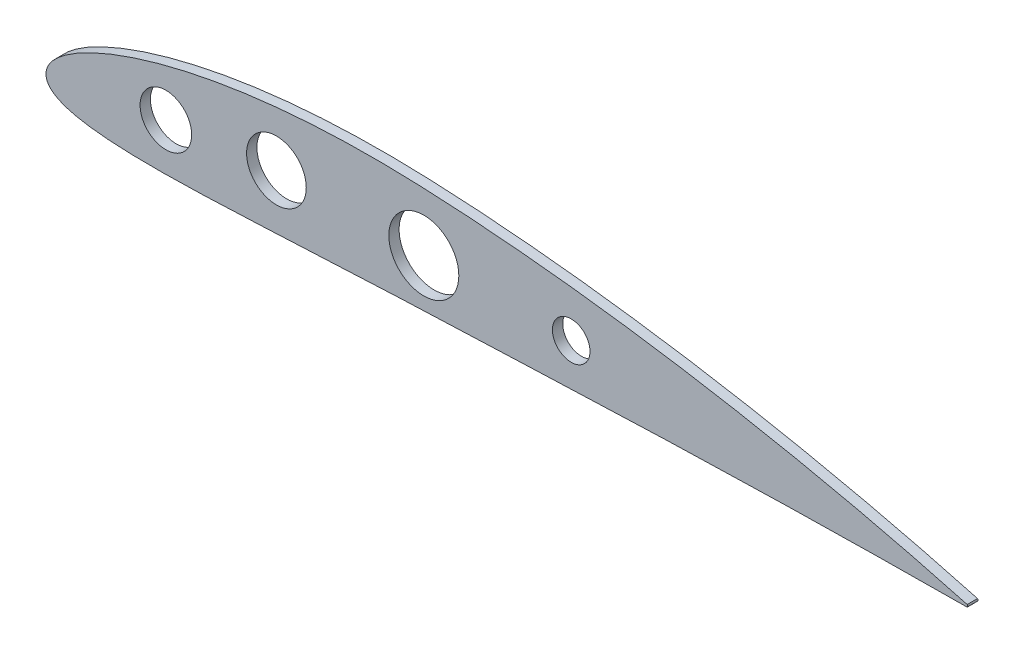
ISO-10303-21;
HEADER;
FILE_DESCRIPTION(('STEP AP214'),'2;1');
FILE_NAME('part.step','',(''),(''),'','','');
FILE_SCHEMA(('AUTOMOTIVE_DESIGN { 1 0 10303 214 1 1 1 1 }'));
ENDSEC;
DATA;
#1=APPLICATION_CONTEXT('core data for automotive mechanical design processes');
#2=APPLICATION_PROTOCOL_DEFINITION('international standard','automotive_design',2000,#1);
#3=PRODUCT_CONTEXT('',#1,'mechanical');
#4=PRODUCT('Part','Part','',(#3));
#5=PRODUCT_RELATED_PRODUCT_CATEGORY('part','',(#4));
#6=PRODUCT_DEFINITION_FORMATION('','',#4);
#7=PRODUCT_DEFINITION_CONTEXT('part definition',#1,'design');
#8=PRODUCT_DEFINITION('design','',#6,#7);
#9=PRODUCT_DEFINITION_SHAPE('','',#8);
#10=(LENGTH_UNIT() NAMED_UNIT(*) SI_UNIT(.MILLI.,.METRE.));
#11=(NAMED_UNIT(*) PLANE_ANGLE_UNIT() SI_UNIT($,.RADIAN.));
#12=(NAMED_UNIT(*) SI_UNIT($,.STERADIAN.) SOLID_ANGLE_UNIT());
#13=UNCERTAINTY_MEASURE_WITH_UNIT(LENGTH_MEASURE(1.E-05),#10,'distance_accuracy_value','');
#14=(GEOMETRIC_REPRESENTATION_CONTEXT(3) GLOBAL_UNCERTAINTY_ASSIGNED_CONTEXT((#13)) GLOBAL_UNIT_ASSIGNED_CONTEXT((#10,
#11,#12)) REPRESENTATION_CONTEXT('',''));
#15=CARTESIAN_POINT('',(0.,0.,0.));
#16=DIRECTION('',(0.,0.,1.));
#17=DIRECTION('',(1.,0.,0.));
#18=AXIS2_PLACEMENT_3D('',#15,#16,#17);
#19=CARTESIAN_POINT('',(123.038526752948,23.1212162426246,1.4));
#20=DIRECTION('',(0.,0.,-1.));
#21=DIRECTION('',(-1.,0.,0.));
#22=AXIS2_PLACEMENT_3D('',#19,#20,#21);
#23=PLANE('',#22);
#24=CARTESIAN_POINT('',(250.,0.315,1.4));
#25=CARTESIAN_POINT('',(249.1556677398,0.545019817836279,1.4));
#26=CARTESIAN_POINT('',(246.72017569763,1.20851624251313,1.4));
#27=CARTESIAN_POINT('',(242.39133208333,2.35833905261626,1.4));
#28=CARTESIAN_POINT('',(236.8497612043,3.78762536446423,1.4));
#29=CARTESIAN_POINT('',(230.779918279366,5.29800883725429,1.4));
#30=CARTESIAN_POINT('',(224.455917947462,6.81286602762795,1.4));
#31=CARTESIAN_POINT('',(218.030543495663,8.2916106324586,1.4));
#32=CARTESIAN_POINT('',(211.562405044606,9.71973505661334,1.4));
#33=CARTESIAN_POINT('',(205.072411508973,11.0923749324442,1.4));
#34=CARTESIAN_POINT('',(198.567970912658,12.4078507263971,1.4));
#35=CARTESIAN_POINT('',(192.05236991352,13.6652979238497,1.4));
#36=CARTESIAN_POINT('',(185.527619972818,14.8640933031022,1.4));
#37=CARTESIAN_POINT('',(178.995338991115,16.0034047787228,1.4));
#38=CARTESIAN_POINT('',(172.457064741278,17.0823881152075,1.4));
#39=CARTESIAN_POINT('',(165.914317094847,18.0998278411168,1.4));
#40=CARTESIAN_POINT('',(159.368680729007,19.0545018148018,1.4));
#41=CARTESIAN_POINT('',(152.821805127969,19.9448856028229,1.4));
#42=CARTESIAN_POINT('',(146.275439401362,20.76928218283,1.4));
#43=CARTESIAN_POINT('',(139.731359791294,21.5256761133202,1.4));
#44=CARTESIAN_POINT('',(133.191836730309,22.2120042488889,1.4));
#45=CARTESIAN_POINT('',(126.658683026114,22.8257214286805,1.4));
#46=CARTESIAN_POINT('',(120.136770918309,23.363973266088,1.4));
#47=CARTESIAN_POINT('',(113.628567140501,23.8246773240715,1.4));
#48=CARTESIAN_POINT('',(107.152732037453,24.2002425936989,1.4));
#49=CARTESIAN_POINT('',(100.741095692949,24.4983995100481,1.4));
#50=CARTESIAN_POINT('',(94.4117527148801,24.6866497684384,1.4));
#51=CARTESIAN_POINT('',(88.1559179929208,24.7400956502598,1.4));
#52=CARTESIAN_POINT('',(81.9490430552625,24.658849143563,1.4));
#53=CARTESIAN_POINT('',(75.7805205915729,24.4410138083138,1.4));
#54=CARTESIAN_POINT('',(69.653692942001,24.0818848206021,1.4));
#55=CARTESIAN_POINT('',(63.5754105017725,23.5780063609574,1.4));
#56=CARTESIAN_POINT('',(57.5551895509689,22.9249466580897,1.4));
#57=CARTESIAN_POINT('',(51.6057626883655,22.1190655216041,1.4));
#58=CARTESIAN_POINT('',(45.7444003114454,21.1565644320825,1.4));
#59=CARTESIAN_POINT('',(39.9958575941734,20.035371389506,1.4));
#60=CARTESIAN_POINT('',(34.397919842374,18.756316234168,1.4));
#61=CARTESIAN_POINT('',(29.0103821035244,17.327615607561,1.4));
#62=CARTESIAN_POINT('',(23.9257984082512,15.7718649214876,1.4));
#63=CARTESIAN_POINT('',(19.2706788398757,14.1342694339559,1.4));
#64=CARTESIAN_POINT('',(15.1790983912921,12.4833354375465,1.4));
#65=CARTESIAN_POINT('',(11.7404757900967,10.8956109948061,1.4));
#66=CARTESIAN_POINT('',(8.95937186897629,9.42957736532332,1.4));
#67=CARTESIAN_POINT('',(6.76089118010329,8.10860319940964,1.4));
#68=CARTESIAN_POINT('',(5.03370974806799,6.92463805475642,1.4));
#69=CARTESIAN_POINT('',(3.67169493343308,5.85422966432144,1.4));
#70=CARTESIAN_POINT('',(2.59210112319415,4.87130536863603,1.4));
#71=CARTESIAN_POINT('',(1.73817566850273,3.95259574329487,1.4));
#72=CARTESIAN_POINT('',(1.06987082981603,3.08094637334676,1.4));
#73=CARTESIAN_POINT('',(0.571645410381898,2.24162210227498,1.4));
#74=CARTESIAN_POINT('',(0.215773898828885,1.43078539700941,1.4));
#75=CARTESIAN_POINT('',(0.102255581551055,0.88324169451159,1.4));
#76=CARTESIAN_POINT('',(0.047975,0.621425,1.4));
#77=B_SPLINE_CURVE_WITH_KNOTS('',3,(#24,#25,#26,#27,#28,#29,#30,#31,#32,#33,#34,#35,#36,#37,#38,
#39,#40,#41,#42,#43,#44,#45,#46,#47,#48,#49,#50,#51,#52,#53,#54,#55,#56,#57,#58,#59,#60,#61,#62,
#63,#64,#65,#66,#67,#68,#69,#70,#71,#72,#73,#74,#75,#76),.UNSPECIFIED.,.F.,.F.,(4,1,1,1,1,1,1,1,
1,1,1,1,1,1,1,1,1,1,1,1,1,1,1,1,1,1,1,1,1,1,1,1,1,1,1,1,1,1,1,1,1,1,1,1,1,1,1,1,1,1,4),(0.,
0.0101621996718152,0.029313053164405,0.0520116049167946,0.0766194676467142,0.101948061207292,
0.127526131749972,0.153184130655642,0.178867887696566,0.204557902716051,0.230245711588722,
0.255925967287604,0.281594302232909,0.307246419826604,0.332878041533464,0.358484538095463,
0.384061185999046,0.409602822472883,0.435103874040524,0.460559416336008,0.485959195382529,
0.511303069995141,0.53655151535457,0.561723365940153,0.586628866723787,0.611085431247163,
0.63525120042125,0.659272175841394,0.683163753229342,0.706922144180534,0.730535909866309,
0.753983199646257,0.777234690063445,0.800246382303428,0.822950708941546,0.845237155368769,
0.866915895838024,0.887662334604257,0.906968280539555,0.924203157053238,0.938878974509372,
0.95093161065299,0.960693484285195,0.968646729467272,0.975232933115936,0.980794743901537,
0.985583761312909,0.989781538836832,0.99352131251264,0.996902112954681,1.),.UNSPECIFIED.);
#78=CARTESIAN_POINT('',(250.,0.315,1.4));
#79=VERTEX_POINT('',#78);
#80=CARTESIAN_POINT('',(0.047975,0.621425,1.4));
#81=VERTEX_POINT('',#80);
#82=EDGE_CURVE('E83',#79,#81,#77,.T.);
#83=ORIENTED_EDGE('',*,*,#82,.T.);
#84=CARTESIAN_POINT('',(0.047975,0.621425,1.4));
#85=CARTESIAN_POINT('',(0.0227138203276048,0.373490085622791,1.4));
#86=CARTESIAN_POINT('',(-0.0278207890067418,-0.122499975050766,1.4));
#87=CARTESIAN_POINT('',(0.0779912124025658,-0.884434590165201,1.4));
#88=CARTESIAN_POINT('',(0.349695650479558,-1.63883807038276,1.4));
#89=CARTESIAN_POINT('',(0.814331135146287,-2.36506892355371,1.4));
#90=CARTESIAN_POINT('',(1.46348078042047,-3.03927524464629,1.4));
#91=CARTESIAN_POINT('',(2.29097301668935,-3.66099946963366,1.4));
#92=CARTESIAN_POINT('',(3.30592875031006,-4.23577962104374,1.4));
#93=CARTESIAN_POINT('',(4.53525561919462,-4.77367414359886,1.4));
#94=CARTESIAN_POINT('',(6.02974568831117,-5.28219216459101,1.4));
#95=CARTESIAN_POINT('',(7.86898121528962,-5.76531667645348,1.4));
#96=CARTESIAN_POINT('',(10.1688313918654,-6.22171659288376,1.4));
#97=CARTESIAN_POINT('',(13.0754381888996,-6.63961873115542,1.4));
#98=CARTESIAN_POINT('',(16.7281153626706,-6.9929567376365,1.4));
#99=CARTESIAN_POINT('',(21.1899520960701,-7.24734514465608,1.4));
#100=CARTESIAN_POINT('',(26.3999844156156,-7.37663884892169,1.4));
#101=CARTESIAN_POINT('',(32.1973985639414,-7.3762569130408,1.4));
#102=CARTESIAN_POINT('',(38.3978067590662,-7.26143657976799,1.4));
#103=CARTESIAN_POINT('',(44.8576217679783,-7.05664135813184,1.4));
#104=CARTESIAN_POINT('',(51.4865430961494,-6.78645353187047,1.4));
#105=CARTESIAN_POINT('',(58.2309809321351,-6.47232458681409,1.4));
#106=CARTESIAN_POINT('',(65.0520946060131,-6.13285226454697,1.4));
#107=CARTESIAN_POINT('',(71.9107727092338,-5.78400517676069,1.4));
#108=CARTESIAN_POINT('',(78.7713755761997,-5.43968045365919,1.4));
#109=CARTESIAN_POINT('',(85.6104986098046,-5.1109512525955,1.4));
#110=CARTESIAN_POINT('',(92.4321075899298,-4.80495332575523,1.4));
#111=CARTESIAN_POINT('',(99.2550311901141,-4.53198165486052,1.4));
#112=CARTESIAN_POINT('',(106.097378404906,-4.2782746709768,1.4));
#113=CARTESIAN_POINT('',(112.96921168025,-4.00308992595863,1.4));
#114=CARTESIAN_POINT('',(119.864404254545,-3.72317618427209,1.4));
#115=CARTESIAN_POINT('',(126.773860473488,-3.44006729642004,1.4));
#116=CARTESIAN_POINT('',(133.681563213165,-3.15869560044929,1.4));
#117=CARTESIAN_POINT('',(140.581870407101,-2.88238072043892,1.4));
#118=CARTESIAN_POINT('',(147.472013761627,-2.6139229582865,1.4));
#119=CARTESIAN_POINT('',(154.352602410646,-2.35562641484789,1.4));
#120=CARTESIAN_POINT('',(161.225044134142,-2.10936992107383,1.4));
#121=CARTESIAN_POINT('',(168.090869746121,-1.87663407429386,1.4));
#122=CARTESIAN_POINT('',(174.951578521953,-1.65864310401416,1.4));
#123=CARTESIAN_POINT('',(181.808595965615,-1.45637812303537,1.4));
#124=CARTESIAN_POINT('',(188.663234462377,-1.27038337720763,1.4));
#125=CARTESIAN_POINT('',(195.516645167653,-1.10111288413947,1.4));
#126=CARTESIAN_POINT('',(202.369532893738,-0.948617188746303,1.4));
#127=CARTESIAN_POINT('',(211.499190290366,-0.767742353448254,1.4));
#128=CARTESIAN_POINT('',(220.6030986659,-0.619939742232208,1.4));
#129=CARTESIAN_POINT('',(229.617630172189,-0.502926179992112,1.4));
#130=CARTESIAN_POINT('',(236.087353853958,-0.431514191705789,1.4));
#131=CARTESIAN_POINT('',(241.980776912644,-0.376520461448702,1.4));
#132=CARTESIAN_POINT('',(246.558970010782,-0.339535885915444,1.4));
#133=CARTESIAN_POINT('',(249.120490964528,-0.321271242454606,1.4));
#134=CARTESIAN_POINT('',(250.,-0.315,1.4));
#135=B_SPLINE_CURVE_WITH_KNOTS('',3,(#84,#85,#86,#87,#88,#89,#90,#91,#92,#93,#94,#95,#96,#97,
#98,#99,#100,#101,#102,#103,#104,#105,#106,#107,#108,#109,#110,#111,#112,#113,#114,#115,#116,
#117,#118,#119,#120,#121,#122,#123,#124,#125,#126,#127,#128,#129,#130,#131,#132,#133,#134),
.UNSPECIFIED.,.F.,.F.,(4,1,1,1,1,1,1,1,1,1,1,1,1,1,1,1,1,1,1,1,1,1,1,1,1,1,1,1,1,1,1,1,1,1,1,1,
1,1,1,1,1,1,1,1,1,1,1,1,4),(0.,0.00294144629716841,0.00588431899986843,0.00901612990907169,
0.0123645467308032,0.0160079338878462,0.0200368451305784,0.0245737277973679,0.029783834741521,
0.0358970100073663,0.043240439578336,0.0522759653413005,0.0636345893302709,0.0779831757705632,
0.0956981612833506,0.116520086015495,0.139660730330278,0.164312170171254,0.189918890388145,
0.216157201054431,0.242837761985605,0.269833582781319,0.296993021546457,0.324123271890544,
0.351139106824528,0.378035508721976,0.404946015910257,0.431960836658272,0.459078394602815,
0.486347400324305,0.513640830241323,0.540928594677757,0.568176028038828,0.595379568955062,
0.622543444942076,0.6496732603013,0.676775201241309,0.70385522836994,0.730918774891245,
0.757971338224895,0.785017763038357,0.812061650836912,0.839103366014866,0.893099151655267,
0.919831064622048,0.945809917390178,0.96968060086528,0.989589706283647,1.),.UNSPECIFIED.);
#136=CARTESIAN_POINT('',(250.,-0.315,1.4));
#137=VERTEX_POINT('',#136);
#138=EDGE_CURVE('E78',#81,#137,#135,.T.);
#139=ORIENTED_EDGE('',*,*,#138,.T.);
#140=CARTESIAN_POINT('',(249.685,0.,1.4));
#141=DIRECTION('',(0.,0.,1.));
#142=DIRECTION('',(-1.,0.,0.));
#143=AXIS2_PLACEMENT_3D('',#140,#141,#142);
#144=CIRCLE('',#143,0.445477272147512);
#145=EDGE_CURVE('E58',#137,#79,#144,.T.);
#146=ORIENTED_EDGE('',*,*,#145,.T.);
#147=EDGE_LOOP('',(#83,#139,#146));
#148=FACE_BOUND('',#147,.T.);
#149=CARTESIAN_POINT('',(62.5326193180369,8.59619720770189,1.4));
#150=DIRECTION('',(0.,0.,1.));
#151=DIRECTION('',(1.,0.,0.));
#152=AXIS2_PLACEMENT_3D('',#149,#150,#151);
#153=CIRCLE('',#152,8.09999999999999);
#154=CARTESIAN_POINT('',(70.6326193180369,8.59619720770189,1.4));
#155=VERTEX_POINT('',#154);
#156=EDGE_CURVE('E94',#155,#155,#153,.T.);
#157=ORIENTED_EDGE('',*,*,#156,.F.);
#158=EDGE_LOOP('',(#157));
#159=FACE_BOUND('',#158,.T.);
#160=CARTESIAN_POINT('',(142.532619318037,8.5961972076993,1.4));
#161=DIRECTION('',(0.,0.,1.));
#162=DIRECTION('',(1.,0.,0.));
#163=AXIS2_PLACEMENT_3D('',#160,#161,#162);
#164=CIRCLE('',#163,5.09999999999998);
#165=CARTESIAN_POINT('',(147.632619318037,8.5961972076993,1.4));
#166=VERTEX_POINT('',#165);
#167=EDGE_CURVE('E147',#166,#166,#164,.T.);
#168=ORIENTED_EDGE('',*,*,#167,.F.);
#169=EDGE_LOOP('',(#168));
#170=FACE_BOUND('',#169,.T.);
#171=CARTESIAN_POINT('',(102.532619318037,8.5961972076993,1.4));
#172=DIRECTION('',(0.,0.,1.));
#173=DIRECTION('',(1.,0.,0.));
#174=AXIS2_PLACEMENT_3D('',#171,#172,#173);
#175=CIRCLE('',#174,9.5);
#176=CARTESIAN_POINT('',(112.032619318037,8.5961972076993,1.4));
#177=VERTEX_POINT('',#176);
#178=EDGE_CURVE('E140',#177,#177,#175,.T.);
#179=ORIENTED_EDGE('',*,*,#178,.F.);
#180=EDGE_LOOP('',(#179));
#181=FACE_BOUND('',#180,.T.);
#182=CARTESIAN_POINT('',(32.5326193180369,5.44814470114742,1.4));
#183=DIRECTION('',(0.,0.,1.));
#184=DIRECTION('',(1.,0.,0.));
#185=AXIS2_PLACEMENT_3D('',#182,#183,#184);
#186=CIRCLE('',#185,7.);
#187=CARTESIAN_POINT('',(39.5326193180369,5.44814470114742,1.4));
#188=VERTEX_POINT('',#187);
#189=EDGE_CURVE('E133',#188,#188,#186,.T.);
#190=ORIENTED_EDGE('',*,*,#189,.F.);
#191=EDGE_LOOP('',(#190));
#192=FACE_BOUND('',#191,.T.);
#193=ADVANCED_FACE('F39',(#148,#159,#170,#181,#192),#23,.F.);
#194=CARTESIAN_POINT('',(123.038526752948,23.1212162426246,-1.4));
#195=DIRECTION('',(0.,0.,-1.));
#196=DIRECTION('',(-1.,0.,0.));
#197=AXIS2_PLACEMENT_3D('',#194,#195,#196);
#198=PLANE('',#197);
#199=CARTESIAN_POINT('',(102.532619318037,8.5961972076993,-1.4));
#200=DIRECTION('',(0.,0.,1.));
#201=DIRECTION('',(1.,0.,0.));
#202=AXIS2_PLACEMENT_3D('',#199,#200,#201);
#203=CIRCLE('',#202,9.5);
#204=CARTESIAN_POINT('',(112.032619318037,8.5961972076993,-1.4));
#205=VERTEX_POINT('',#204);
#206=EDGE_CURVE('E137',#205,#205,#203,.T.);
#207=ORIENTED_EDGE('',*,*,#206,.T.);
#208=EDGE_LOOP('',(#207));
#209=FACE_BOUND('',#208,.T.);
#210=CARTESIAN_POINT('',(62.5326193180369,8.59619720770189,-1.4));
#211=DIRECTION('',(0.,0.,1.));
#212=DIRECTION('',(1.,0.,0.));
#213=AXIS2_PLACEMENT_3D('',#210,#211,#212);
#214=CIRCLE('',#213,8.09999999999999);
#215=CARTESIAN_POINT('',(70.6326193180369,8.59619720770189,-1.4));
#216=VERTEX_POINT('',#215);
#217=EDGE_CURVE('E100',#216,#216,#214,.T.);
#218=ORIENTED_EDGE('',*,*,#217,.T.);
#219=EDGE_LOOP('',(#218));
#220=FACE_BOUND('',#219,.T.);
#221=CARTESIAN_POINT('',(250.,0.315,-1.4));
#222=CARTESIAN_POINT('',(249.1556677398,0.545019817836279,-1.4));
#223=CARTESIAN_POINT('',(246.72017569763,1.20851624251313,-1.4));
#224=CARTESIAN_POINT('',(242.39133208333,2.35833905261626,-1.4));
#225=CARTESIAN_POINT('',(236.8497612043,3.78762536446423,-1.4));
#226=CARTESIAN_POINT('',(230.779918279366,5.29800883725429,-1.4));
#227=CARTESIAN_POINT('',(224.455917947462,6.81286602762795,-1.4));
#228=CARTESIAN_POINT('',(218.030543495663,8.2916106324586,-1.4));
#229=CARTESIAN_POINT('',(211.562405044606,9.71973505661334,-1.4));
#230=CARTESIAN_POINT('',(205.072411508973,11.0923749324442,-1.4));
#231=CARTESIAN_POINT('',(198.567970912658,12.4078507263971,-1.4));
#232=CARTESIAN_POINT('',(192.05236991352,13.6652979238497,-1.4));
#233=CARTESIAN_POINT('',(185.527619972818,14.8640933031022,-1.4));
#234=CARTESIAN_POINT('',(178.995338991115,16.0034047787228,-1.4));
#235=CARTESIAN_POINT('',(172.457064741278,17.0823881152075,-1.4));
#236=CARTESIAN_POINT('',(165.914317094847,18.0998278411168,-1.4));
#237=CARTESIAN_POINT('',(159.368680729007,19.0545018148018,-1.4));
#238=CARTESIAN_POINT('',(152.821805127969,19.9448856028229,-1.4));
#239=CARTESIAN_POINT('',(146.275439401362,20.76928218283,-1.4));
#240=CARTESIAN_POINT('',(139.731359791294,21.5256761133202,-1.4));
#241=CARTESIAN_POINT('',(133.191836730309,22.2120042488889,-1.4));
#242=CARTESIAN_POINT('',(126.658683026114,22.8257214286805,-1.4));
#243=CARTESIAN_POINT('',(120.136770918309,23.363973266088,-1.4));
#244=CARTESIAN_POINT('',(113.628567140501,23.8246773240715,-1.4));
#245=CARTESIAN_POINT('',(107.152732037453,24.2002425936989,-1.4));
#246=CARTESIAN_POINT('',(100.741095692949,24.4983995100481,-1.4));
#247=CARTESIAN_POINT('',(94.4117527148801,24.6866497684384,-1.4));
#248=CARTESIAN_POINT('',(88.1559179929208,24.7400956502598,-1.4));
#249=CARTESIAN_POINT('',(81.9490430552625,24.658849143563,-1.4));
#250=CARTESIAN_POINT('',(75.7805205915729,24.4410138083138,-1.4));
#251=CARTESIAN_POINT('',(69.653692942001,24.0818848206021,-1.4));
#252=CARTESIAN_POINT('',(63.5754105017725,23.5780063609574,-1.4));
#253=CARTESIAN_POINT('',(57.5551895509689,22.9249466580897,-1.4));
#254=CARTESIAN_POINT('',(51.6057626883655,22.1190655216041,-1.4));
#255=CARTESIAN_POINT('',(45.7444003114454,21.1565644320825,-1.4));
#256=CARTESIAN_POINT('',(39.9958575941734,20.035371389506,-1.4));
#257=CARTESIAN_POINT('',(34.397919842374,18.756316234168,-1.4));
#258=CARTESIAN_POINT('',(29.0103821035244,17.327615607561,-1.4));
#259=CARTESIAN_POINT('',(23.9257984082512,15.7718649214876,-1.4));
#260=CARTESIAN_POINT('',(19.2706788398757,14.1342694339559,-1.4));
#261=CARTESIAN_POINT('',(15.1790983912921,12.4833354375465,-1.4));
#262=CARTESIAN_POINT('',(11.7404757900967,10.8956109948061,-1.4));
#263=CARTESIAN_POINT('',(8.95937186897629,9.42957736532332,-1.4));
#264=CARTESIAN_POINT('',(6.76089118010329,8.10860319940964,-1.4));
#265=CARTESIAN_POINT('',(5.03370974806799,6.92463805475642,-1.4));
#266=CARTESIAN_POINT('',(3.67169493343308,5.85422966432144,-1.4));
#267=CARTESIAN_POINT('',(2.59210112319415,4.87130536863603,-1.4));
#268=CARTESIAN_POINT('',(1.73817566850273,3.95259574329487,-1.4));
#269=CARTESIAN_POINT('',(1.06987082981603,3.08094637334676,-1.4));
#270=CARTESIAN_POINT('',(0.571645410381898,2.24162210227498,-1.4));
#271=CARTESIAN_POINT('',(0.215773898828885,1.43078539700941,-1.4));
#272=CARTESIAN_POINT('',(0.102255581551055,0.88324169451159,-1.4));
#273=CARTESIAN_POINT('',(0.047975,0.621425,-1.4));
#274=B_SPLINE_CURVE_WITH_KNOTS('',3,(#221,#222,#223,#224,#225,#226,#227,#228,#229,#230,#231,
#232,#233,#234,#235,#236,#237,#238,#239,#240,#241,#242,#243,#244,#245,#246,#247,#248,#249,#250,
#251,#252,#253,#254,#255,#256,#257,#258,#259,#260,#261,#262,#263,#264,#265,#266,#267,#268,#269,
#270,#271,#272,#273),.UNSPECIFIED.,.F.,.F.,(4,1,1,1,1,1,1,1,1,1,1,1,1,1,1,1,1,1,1,1,1,1,1,1,1,1,
1,1,1,1,1,1,1,1,1,1,1,1,1,1,1,1,1,1,1,1,1,1,1,1,4),(0.,0.0101621996718152,0.029313053164405,
0.0520116049167946,0.0766194676467142,0.101948061207292,0.127526131749972,0.153184130655642,
0.178867887696566,0.204557902716051,0.230245711588722,0.255925967287604,0.281594302232909,
0.307246419826604,0.332878041533464,0.358484538095463,0.384061185999046,0.409602822472883,
0.435103874040524,0.460559416336008,0.485959195382529,0.511303069995141,0.53655151535457,
0.561723365940153,0.586628866723787,0.611085431247163,0.63525120042125,0.659272175841394,
0.683163753229342,0.706922144180534,0.730535909866309,0.753983199646257,0.777234690063445,
0.800246382303428,0.822950708941546,0.845237155368769,0.866915895838024,0.887662334604257,
0.906968280539555,0.924203157053238,0.938878974509372,0.95093161065299,0.960693484285195,
0.968646729467272,0.975232933115936,0.980794743901537,0.985583761312909,0.989781538836832,
0.99352131251264,0.996902112954681,1.),.UNSPECIFIED.);
#275=CARTESIAN_POINT('',(250.,0.315,-1.4));
#276=VERTEX_POINT('',#275);
#277=CARTESIAN_POINT('',(0.047975,0.621425,-1.4));
#278=VERTEX_POINT('',#277);
#279=EDGE_CURVE('E90',#276,#278,#274,.T.);
#280=ORIENTED_EDGE('',*,*,#279,.F.);
#281=CARTESIAN_POINT('',(249.685,0.,-1.4));
#282=DIRECTION('',(0.,0.,1.));
#283=DIRECTION('',(-1.,0.,0.));
#284=AXIS2_PLACEMENT_3D('',#281,#282,#283);
#285=CIRCLE('',#284,0.445477272147512);
#286=CARTESIAN_POINT('',(250.,-0.315,-1.4));
#287=VERTEX_POINT('',#286);
#288=EDGE_CURVE('E75',#287,#276,#285,.T.);
#289=ORIENTED_EDGE('',*,*,#288,.F.);
#290=CARTESIAN_POINT('',(0.047975,0.621425,-1.4));
#291=CARTESIAN_POINT('',(0.0227138203276048,0.373490085622791,-1.4));
#292=CARTESIAN_POINT('',(-0.0278207890067418,-0.122499975050766,-1.4));
#293=CARTESIAN_POINT('',(0.0779912124025658,-0.884434590165201,-1.4));
#294=CARTESIAN_POINT('',(0.349695650479558,-1.63883807038276,-1.4));
#295=CARTESIAN_POINT('',(0.814331135146287,-2.36506892355371,-1.4));
#296=CARTESIAN_POINT('',(1.46348078042047,-3.03927524464629,-1.4));
#297=CARTESIAN_POINT('',(2.29097301668935,-3.66099946963366,-1.4));
#298=CARTESIAN_POINT('',(3.30592875031006,-4.23577962104374,-1.4));
#299=CARTESIAN_POINT('',(4.53525561919462,-4.77367414359886,-1.4));
#300=CARTESIAN_POINT('',(6.02974568831117,-5.28219216459101,-1.4));
#301=CARTESIAN_POINT('',(7.86898121528962,-5.76531667645348,-1.4));
#302=CARTESIAN_POINT('',(10.1688313918654,-6.22171659288376,-1.4));
#303=CARTESIAN_POINT('',(13.0754381888996,-6.63961873115542,-1.4));
#304=CARTESIAN_POINT('',(16.7281153626706,-6.9929567376365,-1.4));
#305=CARTESIAN_POINT('',(21.1899520960701,-7.24734514465608,-1.4));
#306=CARTESIAN_POINT('',(26.3999844156156,-7.37663884892169,-1.4));
#307=CARTESIAN_POINT('',(32.1973985639414,-7.3762569130408,-1.4));
#308=CARTESIAN_POINT('',(38.3978067590662,-7.26143657976799,-1.4));
#309=CARTESIAN_POINT('',(44.8576217679783,-7.05664135813184,-1.4));
#310=CARTESIAN_POINT('',(51.4865430961494,-6.78645353187047,-1.4));
#311=CARTESIAN_POINT('',(58.2309809321351,-6.47232458681409,-1.4));
#312=CARTESIAN_POINT('',(65.0520946060131,-6.13285226454697,-1.4));
#313=CARTESIAN_POINT('',(71.9107727092338,-5.78400517676069,-1.4));
#314=CARTESIAN_POINT('',(78.7713755761997,-5.43968045365919,-1.4));
#315=CARTESIAN_POINT('',(85.6104986098046,-5.1109512525955,-1.4));
#316=CARTESIAN_POINT('',(92.4321075899298,-4.80495332575523,-1.4));
#317=CARTESIAN_POINT('',(99.2550311901141,-4.53198165486052,-1.4));
#318=CARTESIAN_POINT('',(106.097378404906,-4.2782746709768,-1.4));
#319=CARTESIAN_POINT('',(112.96921168025,-4.00308992595863,-1.4));
#320=CARTESIAN_POINT('',(119.864404254545,-3.72317618427209,-1.4));
#321=CARTESIAN_POINT('',(126.773860473488,-3.44006729642004,-1.4));
#322=CARTESIAN_POINT('',(133.681563213165,-3.15869560044929,-1.4));
#323=CARTESIAN_POINT('',(140.581870407101,-2.88238072043892,-1.4));
#324=CARTESIAN_POINT('',(147.472013761627,-2.6139229582865,-1.4));
#325=CARTESIAN_POINT('',(154.352602410646,-2.35562641484789,-1.4));
#326=CARTESIAN_POINT('',(161.225044134142,-2.10936992107383,-1.4));
#327=CARTESIAN_POINT('',(168.090869746121,-1.87663407429386,-1.4));
#328=CARTESIAN_POINT('',(174.951578521953,-1.65864310401416,-1.4));
#329=CARTESIAN_POINT('',(181.808595965615,-1.45637812303537,-1.4));
#330=CARTESIAN_POINT('',(188.663234462377,-1.27038337720763,-1.4));
#331=CARTESIAN_POINT('',(195.516645167653,-1.10111288413947,-1.4));
#332=CARTESIAN_POINT('',(202.369532893738,-0.948617188746303,-1.4));
#333=CARTESIAN_POINT('',(211.499190290366,-0.767742353448254,-1.4));
#334=CARTESIAN_POINT('',(220.6030986659,-0.619939742232208,-1.4));
#335=CARTESIAN_POINT('',(229.617630172189,-0.502926179992112,-1.4));
#336=CARTESIAN_POINT('',(236.087353853958,-0.431514191705789,-1.4));
#337=CARTESIAN_POINT('',(241.980776912644,-0.376520461448702,-1.4));
#338=CARTESIAN_POINT('',(246.558970010782,-0.339535885915444,-1.4));
#339=CARTESIAN_POINT('',(249.120490964528,-0.321271242454606,-1.4));
#340=CARTESIAN_POINT('',(250.,-0.315,-1.4));
#341=B_SPLINE_CURVE_WITH_KNOTS('',3,(#290,#291,#292,#293,#294,#295,#296,#297,#298,#299,#300,
#301,#302,#303,#304,#305,#306,#307,#308,#309,#310,#311,#312,#313,#314,#315,#316,#317,#318,#319,
#320,#321,#322,#323,#324,#325,#326,#327,#328,#329,#330,#331,#332,#333,#334,#335,#336,#337,#338,
#339,#340),.UNSPECIFIED.,.F.,.F.,(4,1,1,1,1,1,1,1,1,1,1,1,1,1,1,1,1,1,1,1,1,1,1,1,1,1,1,1,1,1,1,
1,1,1,1,1,1,1,1,1,1,1,1,1,1,1,1,1,4),(0.,0.00294144629716841,0.00588431899986843,
0.00901612990907169,0.0123645467308032,0.0160079338878462,0.0200368451305784,0.0245737277973679,
0.029783834741521,0.0358970100073663,0.043240439578336,0.0522759653413005,0.0636345893302709,
0.0779831757705632,0.0956981612833506,0.116520086015495,0.139660730330278,0.164312170171254,
0.189918890388145,0.216157201054431,0.242837761985605,0.269833582781319,0.296993021546457,
0.324123271890544,0.351139106824528,0.378035508721976,0.404946015910257,0.431960836658272,
0.459078394602815,0.486347400324305,0.513640830241323,0.540928594677757,0.568176028038828,
0.595379568955062,0.622543444942076,0.6496732603013,0.676775201241309,0.70385522836994,
0.730918774891245,0.757971338224895,0.785017763038357,0.812061650836912,0.839103366014866,
0.893099151655267,0.919831064622048,0.945809917390178,0.96968060086528,0.989589706283647,1.),.UNSPECIFIED.);
#342=EDGE_CURVE('E70',#278,#287,#341,.T.);
#343=ORIENTED_EDGE('',*,*,#342,.F.);
#344=EDGE_LOOP('',(#280,#289,#343));
#345=FACE_BOUND('',#344,.T.);
#346=CARTESIAN_POINT('',(142.532619318037,8.5961972076993,-1.4));
#347=DIRECTION('',(0.,0.,1.));
#348=DIRECTION('',(1.,0.,0.));
#349=AXIS2_PLACEMENT_3D('',#346,#347,#348);
#350=CIRCLE('',#349,5.09999999999998);
#351=CARTESIAN_POINT('',(147.632619318037,8.5961972076993,-1.4));
#352=VERTEX_POINT('',#351);
#353=EDGE_CURVE('E127',#352,#352,#350,.T.);
#354=ORIENTED_EDGE('',*,*,#353,.T.);
#355=EDGE_LOOP('',(#354));
#356=FACE_BOUND('',#355,.T.);
#357=CARTESIAN_POINT('',(32.5326193180369,5.44814470114742,-1.4));
#358=DIRECTION('',(0.,0.,1.));
#359=DIRECTION('',(1.,0.,0.));
#360=AXIS2_PLACEMENT_3D('',#357,#358,#359);
#361=CIRCLE('',#360,7.);
#362=CARTESIAN_POINT('',(39.5326193180369,5.44814470114742,-1.4));
#363=VERTEX_POINT('',#362);
#364=EDGE_CURVE('E130',#363,#363,#361,.T.);
#365=ORIENTED_EDGE('',*,*,#364,.T.);
#366=EDGE_LOOP('',(#365));
#367=FACE_BOUND('',#366,.T.);
#368=ADVANCED_FACE('F119',(#209,#220,#345,#356,#367),#198,.T.);
#369=DIRECTION('',(0.,0.,-1.));
#370=VECTOR('',#369,1.);
#371=SURFACE_OF_LINEAR_EXTRUSION('',#77,#370);
#372=ORIENTED_EDGE('',*,*,#279,.T.);
#373=DIRECTION('',(0.,0.,-1.));
#374=VECTOR('',#373,1.);
#375=CARTESIAN_POINT('',(0.047975,0.621425,1.4));
#376=LINE('',#375,#374);
#377=EDGE_CURVE('E11',#81,#278,#376,.T.);
#378=ORIENTED_EDGE('',*,*,#377,.F.);
#379=ORIENTED_EDGE('',*,*,#82,.F.);
#380=DIRECTION('',(0.,0.,-1.));
#381=VECTOR('',#380,1.);
#382=CARTESIAN_POINT('',(250.,0.315,1.4));
#383=LINE('',#382,#381);
#384=EDGE_CURVE('E91',#79,#276,#383,.T.);
#385=ORIENTED_EDGE('',*,*,#384,.T.);
#386=EDGE_LOOP('',(#372,#378,#379,#385));
#387=FACE_BOUND('',#386,.T.);
#388=ADVANCED_FACE('F41',(#387),#371,.F.);
#389=DIRECTION('',(0.,0.,-1.));
#390=VECTOR('',#389,1.);
#391=SURFACE_OF_LINEAR_EXTRUSION('',#135,#390);
#392=ORIENTED_EDGE('',*,*,#342,.T.);
#393=DIRECTION('',(0.,0.,-1.));
#394=VECTOR('',#393,1.);
#395=CARTESIAN_POINT('',(250.,-0.315,1.4));
#396=LINE('',#395,#394);
#397=EDGE_CURVE('E50',#137,#287,#396,.T.);
#398=ORIENTED_EDGE('',*,*,#397,.F.);
#399=ORIENTED_EDGE('',*,*,#138,.F.);
#400=ORIENTED_EDGE('',*,*,#377,.T.);
#401=EDGE_LOOP('',(#392,#398,#399,#400));
#402=FACE_BOUND('',#401,.T.);
#403=ADVANCED_FACE('F79',(#402),#391,.F.);
#404=CARTESIAN_POINT('',(249.685,0.,1.4));
#405=DIRECTION('',(0.,0.,-1.));
#406=DIRECTION('',(-1.,0.,0.));
#407=AXIS2_PLACEMENT_3D('',#404,#405,#406);
#408=CYLINDRICAL_SURFACE('',#407,0.445477272147512);
#409=ORIENTED_EDGE('',*,*,#288,.T.);
#410=ORIENTED_EDGE('',*,*,#384,.F.);
#411=ORIENTED_EDGE('',*,*,#145,.F.);
#412=ORIENTED_EDGE('',*,*,#397,.T.);
#413=EDGE_LOOP('',(#409,#410,#411,#412));
#414=FACE_BOUND('',#413,.T.);
#415=ADVANCED_FACE('F118',(#414),#408,.T.);
#416=CARTESIAN_POINT('',(62.5326193180369,8.59619720770189,1.4));
#417=DIRECTION('',(0.,0.,-1.));
#418=DIRECTION('',(-1.,0.,0.));
#419=AXIS2_PLACEMENT_3D('',#416,#417,#418);
#420=CYLINDRICAL_SURFACE('',#419,8.09999999999999);
#421=ORIENTED_EDGE('',*,*,#156,.T.);
#422=EDGE_LOOP('',(#421));
#423=FACE_BOUND('',#422,.T.);
#424=ORIENTED_EDGE('',*,*,#217,.F.);
#425=EDGE_LOOP('',(#424));
#426=FACE_BOUND('',#425,.T.);
#427=ADVANCED_FACE('F170',(#423,#426),#420,.F.);
#428=CARTESIAN_POINT('',(142.532619318037,8.5961972076993,1.4));
#429=DIRECTION('',(0.,0.,-1.));
#430=DIRECTION('',(-1.,0.,0.));
#431=AXIS2_PLACEMENT_3D('',#428,#429,#430);
#432=CYLINDRICAL_SURFACE('',#431,5.09999999999998);
#433=ORIENTED_EDGE('',*,*,#167,.T.);
#434=EDGE_LOOP('',(#433));
#435=FACE_BOUND('',#434,.T.);
#436=ORIENTED_EDGE('',*,*,#353,.F.);
#437=EDGE_LOOP('',(#436));
#438=FACE_BOUND('',#437,.T.);
#439=ADVANCED_FACE('F176',(#435,#438),#432,.F.);
#440=CARTESIAN_POINT('',(102.532619318037,8.5961972076993,1.4));
#441=DIRECTION('',(0.,0.,-1.));
#442=DIRECTION('',(-1.,0.,0.));
#443=AXIS2_PLACEMENT_3D('',#440,#441,#442);
#444=CYLINDRICAL_SURFACE('',#443,9.5);
#445=ORIENTED_EDGE('',*,*,#178,.T.);
#446=EDGE_LOOP('',(#445));
#447=FACE_BOUND('',#446,.T.);
#448=ORIENTED_EDGE('',*,*,#206,.F.);
#449=EDGE_LOOP('',(#448));
#450=FACE_BOUND('',#449,.T.);
#451=ADVANCED_FACE('F180',(#447,#450),#444,.F.);
#452=CARTESIAN_POINT('',(32.5326193180369,5.44814470114742,1.4));
#453=DIRECTION('',(0.,0.,-1.));
#454=DIRECTION('',(-1.,0.,0.));
#455=AXIS2_PLACEMENT_3D('',#452,#453,#454);
#456=CYLINDRICAL_SURFACE('',#455,7.);
#457=ORIENTED_EDGE('',*,*,#189,.T.);
#458=EDGE_LOOP('',(#457));
#459=FACE_BOUND('',#458,.T.);
#460=ORIENTED_EDGE('',*,*,#364,.F.);
#461=EDGE_LOOP('',(#460));
#462=FACE_BOUND('',#461,.T.);
#463=ADVANCED_FACE('F184',(#459,#462),#456,.F.);
#464=CLOSED_SHELL('',(#193,#368,#388,#403,#415,#427,#439,#451,#463));
#465=MANIFOLD_SOLID_BREP('B2',#464);
#466=ADVANCED_BREP_SHAPE_REPRESENTATION('',(#18,#465),#14);
#467=SHAPE_DEFINITION_REPRESENTATION(#9,#466);
ENDSEC;
END-ISO-10303-21;
